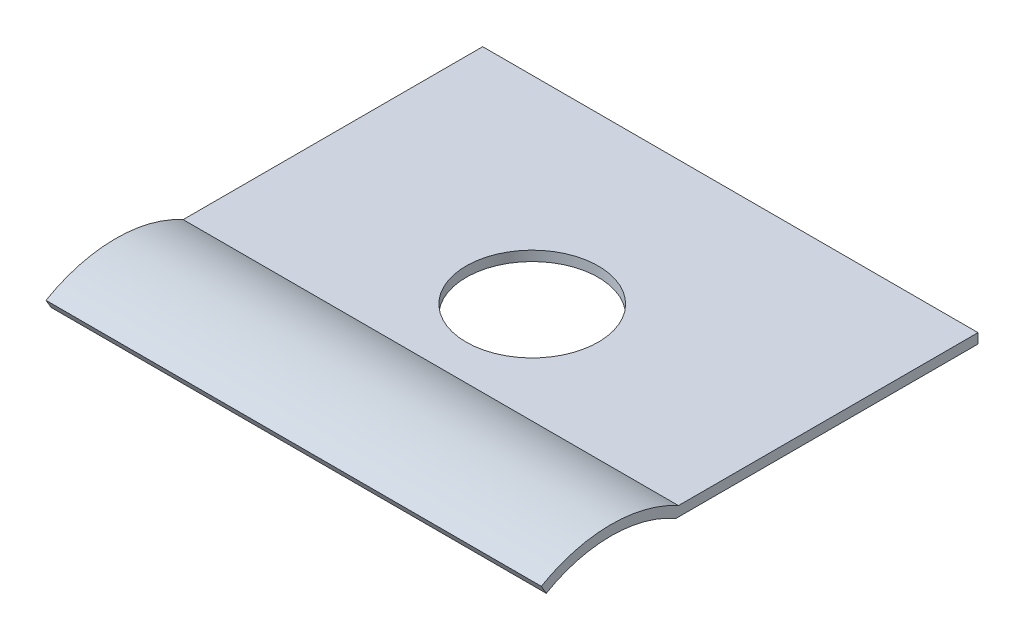
ISO-10303-21;
HEADER;
FILE_DESCRIPTION(('STEP AP214'),'2;1');
FILE_NAME('part.step','',(''),(''),'','','');
FILE_SCHEMA(('AUTOMOTIVE_DESIGN { 1 0 10303 214 1 1 1 1 }'));
ENDSEC;
DATA;
#1=APPLICATION_CONTEXT('core data for automotive mechanical design processes');
#2=APPLICATION_PROTOCOL_DEFINITION('international standard','automotive_design',2000,#1);
#3=PRODUCT_CONTEXT('',#1,'mechanical');
#4=PRODUCT('Part','Part','',(#3));
#5=PRODUCT_RELATED_PRODUCT_CATEGORY('part','',(#4));
#6=PRODUCT_DEFINITION_FORMATION('','',#4);
#7=PRODUCT_DEFINITION_CONTEXT('part definition',#1,'design');
#8=PRODUCT_DEFINITION('design','',#6,#7);
#9=PRODUCT_DEFINITION_SHAPE('','',#8);
#10=(LENGTH_UNIT() NAMED_UNIT(*) SI_UNIT(.MILLI.,.METRE.));
#11=(NAMED_UNIT(*) PLANE_ANGLE_UNIT() SI_UNIT($,.RADIAN.));
#12=(NAMED_UNIT(*) SI_UNIT($,.STERADIAN.) SOLID_ANGLE_UNIT());
#13=UNCERTAINTY_MEASURE_WITH_UNIT(LENGTH_MEASURE(1.E-05),#10,'distance_accuracy_value','');
#14=(GEOMETRIC_REPRESENTATION_CONTEXT(3) GLOBAL_UNCERTAINTY_ASSIGNED_CONTEXT((#13)) GLOBAL_UNIT_ASSIGNED_CONTEXT((#10,
#11,#12)) REPRESENTATION_CONTEXT('',''));
#15=CARTESIAN_POINT('',(0.,0.,0.));
#16=DIRECTION('',(0.,0.,1.));
#17=DIRECTION('',(1.,0.,0.));
#18=AXIS2_PLACEMENT_3D('',#15,#16,#17);
#19=CARTESIAN_POINT('',(15.,-3.39914970985392,-1.9625));
#20=DIRECTION('',(-1.,0.,0.));
#21=DIRECTION('',(0.,0.,1.));
#22=AXIS2_PLACEMENT_3D('',#19,#20,#21);
#23=CYLINDRICAL_SURFACE('',#22,3.925);
#24=CARTESIAN_POINT('',(0.,-3.39914970985392,-1.9625));
#25=DIRECTION('',(-1.,0.,0.));
#26=DIRECTION('',(0.,0.,1.));
#27=AXIS2_PLACEMENT_3D('',#24,#25,#26);
#28=CIRCLE('',#27,3.925);
#29=CARTESIAN_POINT('',(0.,0.,0.));
#30=VERTEX_POINT('',#29);
#31=CARTESIAN_POINT('',(0.,0.,-3.925));
#32=VERTEX_POINT('',#31);
#33=EDGE_CURVE('E146',#30,#32,#28,.T.);
#34=ORIENTED_EDGE('',*,*,#33,.T.);
#35=DIRECTION('',(-1.,0.,0.));
#36=VECTOR('',#35,1.);
#37=CARTESIAN_POINT('',(15.,0.,-3.925));
#38=LINE('',#37,#36);
#39=CARTESIAN_POINT('',(15.,0.,-3.925));
#40=VERTEX_POINT('',#39);
#41=EDGE_CURVE('E13',#40,#32,#38,.T.);
#42=ORIENTED_EDGE('',*,*,#41,.F.);
#43=CARTESIAN_POINT('',(15.,-3.39914970985392,-1.9625));
#44=DIRECTION('',(-1.,0.,0.));
#45=DIRECTION('',(0.,0.,1.));
#46=AXIS2_PLACEMENT_3D('',#43,#44,#45);
#47=CIRCLE('',#46,3.925);
#48=CARTESIAN_POINT('',(15.,0.,0.));
#49=VERTEX_POINT('',#48);
#50=EDGE_CURVE('E163',#49,#40,#47,.T.);
#51=ORIENTED_EDGE('',*,*,#50,.F.);
#52=DIRECTION('',(-1.,0.,0.));
#53=VECTOR('',#52,1.);
#54=CARTESIAN_POINT('',(15.,0.,0.));
#55=LINE('',#54,#53);
#56=EDGE_CURVE('E142',#49,#30,#55,.T.);
#57=ORIENTED_EDGE('',*,*,#56,.T.);
#58=EDGE_LOOP('',(#34,#42,#51,#57));
#59=FACE_BOUND('',#58,.T.);
#60=ADVANCED_FACE('F56',(#59),#23,.F.);
#61=CARTESIAN_POINT('',(15.,0.,-3.925));
#62=DIRECTION('',(0.,1.,0.));
#63=DIRECTION('',(0.,0.,1.));
#64=AXIS2_PLACEMENT_3D('',#61,#62,#63);
#65=PLANE('',#64);
#66=CARTESIAN_POINT('',(7.5,0.,-7.075));
#67=DIRECTION('',(0.,1.,0.));
#68=DIRECTION('',(0.,0.,1.));
#69=AXIS2_PLACEMENT_3D('',#66,#67,#68);
#70=CIRCLE('',#69,2.);
#71=CARTESIAN_POINT('',(7.5,0.,-5.075));
#72=VERTEX_POINT('',#71);
#73=EDGE_CURVE('E151',#72,#72,#70,.T.);
#74=ORIENTED_EDGE('',*,*,#73,.T.);
#75=EDGE_LOOP('',(#74));
#76=FACE_BOUND('',#75,.T.);
#77=DIRECTION('',(0.,0.,-1.));
#78=VECTOR('',#77,1.);
#79=CARTESIAN_POINT('',(0.,0.,-3.925));
#80=LINE('',#79,#78);
#81=CARTESIAN_POINT('',(0.,0.,-13.075));
#82=VERTEX_POINT('',#81);
#83=EDGE_CURVE('E150',#32,#82,#80,.T.);
#84=ORIENTED_EDGE('',*,*,#83,.T.);
#85=DIRECTION('',(-1.,0.,0.));
#86=VECTOR('',#85,1.);
#87=CARTESIAN_POINT('',(15.,0.,-13.075));
#88=LINE('',#87,#86);
#89=CARTESIAN_POINT('',(15.,0.,-13.075));
#90=VERTEX_POINT('',#89);
#91=EDGE_CURVE('E65',#90,#82,#88,.T.);
#92=ORIENTED_EDGE('',*,*,#91,.F.);
#93=DIRECTION('',(0.,0.,-1.));
#94=VECTOR('',#93,1.);
#95=CARTESIAN_POINT('',(15.,0.,-3.925));
#96=LINE('',#95,#94);
#97=EDGE_CURVE('E110',#40,#90,#96,.T.);
#98=ORIENTED_EDGE('',*,*,#97,.F.);
#99=ORIENTED_EDGE('',*,*,#41,.T.);
#100=EDGE_LOOP('',(#84,#92,#98,#99));
#101=FACE_BOUND('',#100,.T.);
#102=ADVANCED_FACE('F192',(#76,#101),#65,.F.);
#103=CARTESIAN_POINT('',(15.,0.3,-13.075));
#104=DIRECTION('',(0.,0.,1.));
#105=DIRECTION('',(1.,0.,0.));
#106=AXIS2_PLACEMENT_3D('',#103,#104,#105);
#107=PLANE('',#106);
#108=DIRECTION('',(0.,1.,0.));
#109=VECTOR('',#108,1.);
#110=CARTESIAN_POINT('',(0.,0.3,-13.075));
#111=LINE('',#110,#109);
#112=CARTESIAN_POINT('',(0.,0.3,-13.075));
#113=VERTEX_POINT('',#112);
#114=EDGE_CURVE('E154',#82,#113,#111,.T.);
#115=ORIENTED_EDGE('',*,*,#114,.T.);
#116=DIRECTION('',(-1.,0.,0.));
#117=VECTOR('',#116,1.);
#118=CARTESIAN_POINT('',(15.,0.3,-13.075));
#119=LINE('',#118,#117);
#120=CARTESIAN_POINT('',(15.,0.3,-13.075));
#121=VERTEX_POINT('',#120);
#122=EDGE_CURVE('E134',#121,#113,#119,.T.);
#123=ORIENTED_EDGE('',*,*,#122,.F.);
#124=DIRECTION('',(0.,1.,0.));
#125=VECTOR('',#124,1.);
#126=CARTESIAN_POINT('',(15.,0.3,-13.075));
#127=LINE('',#126,#125);
#128=EDGE_CURVE('E123',#90,#121,#127,.T.);
#129=ORIENTED_EDGE('',*,*,#128,.F.);
#130=ORIENTED_EDGE('',*,*,#91,.T.);
#131=EDGE_LOOP('',(#115,#123,#129,#130));
#132=FACE_BOUND('',#131,.T.);
#133=ADVANCED_FACE('F174',(#132),#107,.F.);
#134=CARTESIAN_POINT('',(15.,0.3,-4.00380262922665));
#135=DIRECTION('',(0.,-1.,0.));
#136=DIRECTION('',(0.,0.,-1.));
#137=AXIS2_PLACEMENT_3D('',#134,#135,#136);
#138=PLANE('',#137);
#139=CARTESIAN_POINT('',(7.5,0.3,-7.075));
#140=DIRECTION('',(0.,1.,0.));
#141=DIRECTION('',(0.,0.,1.));
#142=AXIS2_PLACEMENT_3D('',#139,#140,#141);
#143=CIRCLE('',#142,2.);
#144=CARTESIAN_POINT('',(7.5,0.3,-5.075));
#145=VERTEX_POINT('',#144);
#146=EDGE_CURVE('E209',#145,#145,#143,.T.);
#147=ORIENTED_EDGE('',*,*,#146,.F.);
#148=EDGE_LOOP('',(#147));
#149=FACE_BOUND('',#148,.T.);
#150=DIRECTION('',(0.,0.,1.));
#151=VECTOR('',#150,1.);
#152=CARTESIAN_POINT('',(0.,0.3,-4.00380262922665));
#153=LINE('',#152,#151);
#154=CARTESIAN_POINT('',(0.,0.299999999999999,-4.00380262922665));
#155=VERTEX_POINT('',#154);
#156=EDGE_CURVE('E132',#113,#155,#153,.T.);
#157=ORIENTED_EDGE('',*,*,#156,.T.);
#158=DIRECTION('',(-1.,0.,0.));
#159=VECTOR('',#158,1.);
#160=CARTESIAN_POINT('',(15.,0.299999999999999,-4.00380262922665));
#161=LINE('',#160,#159);
#162=CARTESIAN_POINT('',(15.,0.299999999999999,-4.00380262922665));
#163=VERTEX_POINT('',#162);
#164=EDGE_CURVE('E129',#163,#155,#161,.T.);
#165=ORIENTED_EDGE('',*,*,#164,.F.);
#166=DIRECTION('',(0.,0.,1.));
#167=VECTOR('',#166,1.);
#168=CARTESIAN_POINT('',(15.,0.3,-4.00380262922665));
#169=LINE('',#168,#167);
#170=EDGE_CURVE('E117',#121,#163,#169,.T.);
#171=ORIENTED_EDGE('',*,*,#170,.F.);
#172=ORIENTED_EDGE('',*,*,#122,.T.);
#173=EDGE_LOOP('',(#157,#165,#171,#172));
#174=FACE_BOUND('',#173,.T.);
#175=ADVANCED_FACE('F130',(#149,#174),#138,.F.);
#176=CARTESIAN_POINT('',(15.,-3.39914970985392,-1.9625));
#177=DIRECTION('',(-1.,0.,0.));
#178=DIRECTION('',(0.,0.,1.));
#179=AXIS2_PLACEMENT_3D('',#176,#177,#178);
#180=CYLINDRICAL_SURFACE('',#179,4.225);
#181=CARTESIAN_POINT('',(0.,-3.39914970985392,-1.9625));
#182=DIRECTION('',(1.,0.,0.));
#183=DIRECTION('',(0.,0.,1.));
#184=AXIS2_PLACEMENT_3D('',#181,#182,#183);
#185=CIRCLE('',#184,4.225);
#186=CARTESIAN_POINT('',(0.,0.259807621135331,0.15));
#187=VERTEX_POINT('',#186);
#188=EDGE_CURVE('E96',#155,#187,#185,.T.);
#189=ORIENTED_EDGE('',*,*,#188,.T.);
#190=DIRECTION('',(-1.,0.,0.));
#191=VECTOR('',#190,1.);
#192=CARTESIAN_POINT('',(15.,0.259807621135331,0.15));
#193=LINE('',#192,#191);
#194=CARTESIAN_POINT('',(15.,0.259807621135331,0.15));
#195=VERTEX_POINT('',#194);
#196=EDGE_CURVE('E135',#195,#187,#193,.T.);
#197=ORIENTED_EDGE('',*,*,#196,.F.);
#198=CARTESIAN_POINT('',(15.,-3.39914970985392,-1.9625));
#199=DIRECTION('',(1.,0.,0.));
#200=DIRECTION('',(0.,0.,1.));
#201=AXIS2_PLACEMENT_3D('',#198,#199,#200);
#202=CIRCLE('',#201,4.225);
#203=EDGE_CURVE('E121',#163,#195,#202,.T.);
#204=ORIENTED_EDGE('',*,*,#203,.F.);
#205=ORIENTED_EDGE('',*,*,#164,.T.);
#206=EDGE_LOOP('',(#189,#197,#204,#205));
#207=FACE_BOUND('',#206,.T.);
#208=ADVANCED_FACE('F137',(#207),#180,.T.);
#209=CARTESIAN_POINT('',(15.,0.259807621135331,0.15));
#210=DIRECTION('',(0.,0.499999999999999,-0.866025403784439));
#211=DIRECTION('',(0.,0.866025403784439,0.499999999999999));
#212=AXIS2_PLACEMENT_3D('',#209,#210,#211);
#213=PLANE('',#212);
#214=DIRECTION('',(0.,-0.866025403784439,-0.499999999999999));
#215=VECTOR('',#214,1.);
#216=CARTESIAN_POINT('',(0.,0.259807621135331,0.15));
#217=LINE('',#216,#215);
#218=EDGE_CURVE('E102',#187,#30,#217,.T.);
#219=ORIENTED_EDGE('',*,*,#218,.T.);
#220=ORIENTED_EDGE('',*,*,#56,.F.);
#221=DIRECTION('',(0.,-0.866025403784439,-0.499999999999999));
#222=VECTOR('',#221,1.);
#223=CARTESIAN_POINT('',(15.,0.259807621135331,0.15));
#224=LINE('',#223,#222);
#225=EDGE_CURVE('E73',#195,#49,#224,.T.);
#226=ORIENTED_EDGE('',*,*,#225,.F.);
#227=ORIENTED_EDGE('',*,*,#196,.T.);
#228=EDGE_LOOP('',(#219,#220,#226,#227));
#229=FACE_BOUND('',#228,.T.);
#230=ADVANCED_FACE('F181',(#229),#213,.F.);
#231=CARTESIAN_POINT('',(15.,-3.39914970985392,-1.9625));
#232=DIRECTION('',(-1.,0.,0.));
#233=DIRECTION('',(0.,0.,1.));
#234=AXIS2_PLACEMENT_3D('',#231,#232,#233);
#235=PLANE('',#234);
#236=ORIENTED_EDGE('',*,*,#50,.T.);
#237=ORIENTED_EDGE('',*,*,#97,.T.);
#238=ORIENTED_EDGE('',*,*,#128,.T.);
#239=ORIENTED_EDGE('',*,*,#170,.T.);
#240=ORIENTED_EDGE('',*,*,#203,.T.);
#241=ORIENTED_EDGE('',*,*,#225,.T.);
#242=EDGE_LOOP('',(#236,#237,#238,#239,#240,#241));
#243=FACE_BOUND('',#242,.T.);
#244=ADVANCED_FACE('F119',(#243),#235,.F.);
#245=CARTESIAN_POINT('',(0.,-3.39914970985392,-1.9625));
#246=DIRECTION('',(-1.,0.,0.));
#247=DIRECTION('',(0.,0.,1.));
#248=AXIS2_PLACEMENT_3D('',#245,#246,#247);
#249=PLANE('',#248);
#250=ORIENTED_EDGE('',*,*,#33,.F.);
#251=ORIENTED_EDGE('',*,*,#218,.F.);
#252=ORIENTED_EDGE('',*,*,#188,.F.);
#253=ORIENTED_EDGE('',*,*,#156,.F.);
#254=ORIENTED_EDGE('',*,*,#114,.F.);
#255=ORIENTED_EDGE('',*,*,#83,.F.);
#256=EDGE_LOOP('',(#250,#251,#252,#253,#254,#255));
#257=FACE_BOUND('',#256,.T.);
#258=ADVANCED_FACE('F177',(#257),#249,.T.);
#259=CARTESIAN_POINT('',(7.5,0.,-7.075));
#260=DIRECTION('',(0.,1.,0.));
#261=DIRECTION('',(0.,0.,1.));
#262=AXIS2_PLACEMENT_3D('',#259,#260,#261);
#263=CYLINDRICAL_SURFACE('',#262,2.);
#264=ORIENTED_EDGE('',*,*,#73,.F.);
#265=EDGE_LOOP('',(#264));
#266=FACE_BOUND('',#265,.T.);
#267=ORIENTED_EDGE('',*,*,#146,.T.);
#268=EDGE_LOOP('',(#267));
#269=FACE_BOUND('',#268,.T.);
#270=ADVANCED_FACE('F234',(#266,#269),#263,.F.);
#271=CLOSED_SHELL('',(#60,#102,#133,#175,#208,#230,#244,#258,#270));
#272=MANIFOLD_SOLID_BREP('B2',#271);
#273=ADVANCED_BREP_SHAPE_REPRESENTATION('',(#18,#272),#14);
#274=SHAPE_DEFINITION_REPRESENTATION(#9,#273);
ENDSEC;
END-ISO-10303-21;
